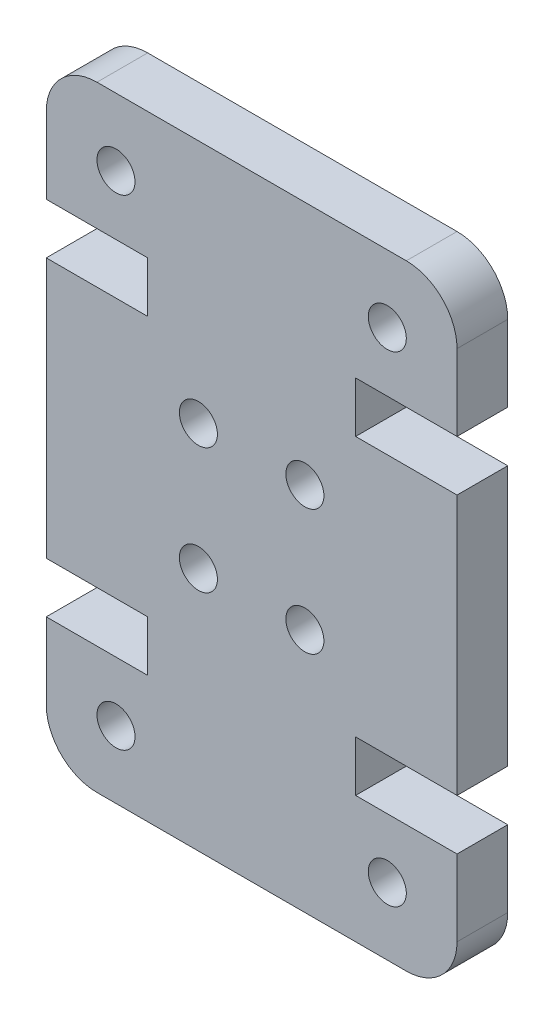
ISO-10303-21;
HEADER;
FILE_DESCRIPTION(('STEP AP214'),'2;1');
FILE_NAME('part.step','',(''),(''),'','','');
FILE_SCHEMA(('AUTOMOTIVE_DESIGN { 1 0 10303 214 1 1 1 1 }'));
ENDSEC;
DATA;
#1=APPLICATION_CONTEXT('core data for automotive mechanical design processes');
#2=APPLICATION_PROTOCOL_DEFINITION('international standard','automotive_design',2000,#1);
#3=PRODUCT_CONTEXT('',#1,'mechanical');
#4=PRODUCT('Part','Part','',(#3));
#5=PRODUCT_RELATED_PRODUCT_CATEGORY('part','',(#4));
#6=PRODUCT_DEFINITION_FORMATION('','',#4);
#7=PRODUCT_DEFINITION_CONTEXT('part definition',#1,'design');
#8=PRODUCT_DEFINITION('design','',#6,#7);
#9=PRODUCT_DEFINITION_SHAPE('','',#8);
#10=(LENGTH_UNIT() NAMED_UNIT(*) SI_UNIT(.MILLI.,.METRE.));
#11=(NAMED_UNIT(*) PLANE_ANGLE_UNIT() SI_UNIT($,.RADIAN.));
#12=(NAMED_UNIT(*) SI_UNIT($,.STERADIAN.) SOLID_ANGLE_UNIT());
#13=UNCERTAINTY_MEASURE_WITH_UNIT(LENGTH_MEASURE(1.E-05),#10,'distance_accuracy_value','');
#14=(GEOMETRIC_REPRESENTATION_CONTEXT(3) GLOBAL_UNCERTAINTY_ASSIGNED_CONTEXT((#13)) GLOBAL_UNIT_ASSIGNED_CONTEXT((#10,
#11,#12)) REPRESENTATION_CONTEXT('',''));
#15=CARTESIAN_POINT('',(0.,0.,0.));
#16=DIRECTION('',(0.,0.,1.));
#17=DIRECTION('',(1.,0.,0.));
#18=AXIS2_PLACEMENT_3D('',#15,#16,#17);
#19=CARTESIAN_POINT('',(14.2,2.,2.));
#20=DIRECTION('',(0.,0.,-1.));
#21=DIRECTION('',(-1.,0.,0.));
#22=AXIS2_PLACEMENT_3D('',#19,#20,#21);
#23=PLANE('',#22);
#24=CARTESIAN_POINT('',(6.00000000000001,9.65355116894447,2.));
#25=DIRECTION('',(0.,0.,1.));
#26=DIRECTION('',(1.,0.,0.));
#27=AXIS2_PLACEMENT_3D('',#24,#25,#26);
#28=CIRCLE('',#27,0.749999999999999);
#29=CARTESIAN_POINT('',(6.75,9.65355116894447,2.));
#30=VERTEX_POINT('',#29);
#31=EDGE_CURVE('E464',#30,#30,#28,.T.);
#32=ORIENTED_EDGE('',*,*,#31,.F.);
#33=EDGE_LOOP('',(#32));
#34=FACE_BOUND('',#33,.T.);
#35=CARTESIAN_POINT('',(10.2,14.6064488310555,2.));
#36=DIRECTION('',(0.,0.,1.));
#37=DIRECTION('',(1.,0.,0.));
#38=AXIS2_PLACEMENT_3D('',#35,#36,#37);
#39=CIRCLE('',#38,0.749999999999998);
#40=CARTESIAN_POINT('',(10.95,14.6064488310555,2.));
#41=VERTEX_POINT('',#40);
#42=EDGE_CURVE('E476',#41,#41,#39,.T.);
#43=ORIENTED_EDGE('',*,*,#42,.F.);
#44=EDGE_LOOP('',(#43));
#45=FACE_BOUND('',#44,.T.);
#46=CARTESIAN_POINT('',(2.75000000000003,21.606448831055,2.));
#47=DIRECTION('',(0.,0.,1.));
#48=DIRECTION('',(-1.,0.,0.));
#49=AXIS2_PLACEMENT_3D('',#46,#47,#48);
#50=CIRCLE('',#49,0.749999999999999);
#51=CARTESIAN_POINT('',(2.00000000000003,21.606448831055,2.));
#52=VERTEX_POINT('',#51);
#53=EDGE_CURVE('E488',#52,#52,#50,.T.);
#54=ORIENTED_EDGE('',*,*,#53,.F.);
#55=EDGE_LOOP('',(#54));
#56=FACE_BOUND('',#55,.T.);
#57=CARTESIAN_POINT('',(13.45,2.65355116894501,2.));
#58=DIRECTION('',(0.,0.,1.));
#59=DIRECTION('',(-1.,0.,0.));
#60=AXIS2_PLACEMENT_3D('',#57,#58,#59);
#61=CIRCLE('',#60,0.75);
#62=CARTESIAN_POINT('',(12.7,2.65355116894501,2.));
#63=VERTEX_POINT('',#62);
#64=EDGE_CURVE('E230',#63,#63,#61,.T.);
#65=ORIENTED_EDGE('',*,*,#64,.F.);
#66=EDGE_LOOP('',(#65));
#67=FACE_BOUND('',#66,.T.);
#68=CARTESIAN_POINT('',(14.2,2.,2.));
#69=DIRECTION('',(0.,0.,1.));
#70=DIRECTION('',(-1.,0.,0.));
#71=AXIS2_PLACEMENT_3D('',#68,#69,#70);
#72=CIRCLE('',#71,2.);
#73=CARTESIAN_POINT('',(14.2,0.,2.));
#74=VERTEX_POINT('',#73);
#75=CARTESIAN_POINT('',(16.2,2.,2.));
#76=VERTEX_POINT('',#75);
#77=EDGE_CURVE('E273',#74,#76,#72,.T.);
#78=ORIENTED_EDGE('',*,*,#77,.T.);
#79=DIRECTION('',(0.,1.,0.));
#80=VECTOR('',#79,1.);
#81=CARTESIAN_POINT('',(16.2,2.,2.));
#82=LINE('',#81,#80);
#83=CARTESIAN_POINT('',(16.2,4.99999999999945,2.));
#84=VERTEX_POINT('',#83);
#85=EDGE_CURVE('E141',#76,#84,#82,.T.);
#86=ORIENTED_EDGE('',*,*,#85,.T.);
#87=DIRECTION('',(-1.,0.,0.));
#88=VECTOR('',#87,1.);
#89=CARTESIAN_POINT('',(12.2,4.99999999999945,2.));
#90=LINE('',#89,#88);
#91=CARTESIAN_POINT('',(12.2,4.99999999999945,2.));
#92=VERTEX_POINT('',#91);
#93=EDGE_CURVE('E336',#84,#92,#90,.T.);
#94=ORIENTED_EDGE('',*,*,#93,.T.);
#95=DIRECTION('',(0.,1.,0.));
#96=VECTOR('',#95,1.);
#97=CARTESIAN_POINT('',(12.2,6.99999999999945,2.));
#98=LINE('',#97,#96);
#99=CARTESIAN_POINT('',(12.2,6.99999999999945,2.));
#100=VERTEX_POINT('',#99);
#101=EDGE_CURVE('E355',#92,#100,#98,.T.);
#102=ORIENTED_EDGE('',*,*,#101,.T.);
#103=DIRECTION('',(1.,0.,0.));
#104=VECTOR('',#103,1.);
#105=CARTESIAN_POINT('',(16.2,6.99999999999945,2.));
#106=LINE('',#105,#104);
#107=CARTESIAN_POINT('',(16.2,6.99999999999945,2.));
#108=VERTEX_POINT('',#107);
#109=EDGE_CURVE('E352',#100,#108,#106,.T.);
#110=ORIENTED_EDGE('',*,*,#109,.T.);
#111=DIRECTION('',(0.,1.,0.));
#112=VECTOR('',#111,1.);
#113=CARTESIAN_POINT('',(16.2,17.2600000000005,2.));
#114=LINE('',#113,#112);
#115=CARTESIAN_POINT('',(16.2,17.2600000000005,2.));
#116=VERTEX_POINT('',#115);
#117=EDGE_CURVE('E354',#108,#116,#114,.T.);
#118=ORIENTED_EDGE('',*,*,#117,.T.);
#119=DIRECTION('',(-1.,0.,0.));
#120=VECTOR('',#119,1.);
#121=CARTESIAN_POINT('',(16.2,17.2600000000005,2.));
#122=LINE('',#121,#120);
#123=CARTESIAN_POINT('',(12.2,17.2600000000005,2.));
#124=VERTEX_POINT('',#123);
#125=EDGE_CURVE('E357',#116,#124,#122,.T.);
#126=ORIENTED_EDGE('',*,*,#125,.T.);
#127=DIRECTION('',(0.,1.,0.));
#128=VECTOR('',#127,1.);
#129=CARTESIAN_POINT('',(12.2,17.2600000000005,2.));
#130=LINE('',#129,#128);
#131=CARTESIAN_POINT('',(12.2,19.2600000000005,2.));
#132=VERTEX_POINT('',#131);
#133=EDGE_CURVE('E363',#124,#132,#130,.T.);
#134=ORIENTED_EDGE('',*,*,#133,.T.);
#135=DIRECTION('',(1.,0.,0.));
#136=VECTOR('',#135,1.);
#137=CARTESIAN_POINT('',(12.2,19.2600000000005,2.));
#138=LINE('',#137,#136);
#139=CARTESIAN_POINT('',(16.2,19.2600000000005,2.));
#140=VERTEX_POINT('',#139);
#141=EDGE_CURVE('E365',#132,#140,#138,.T.);
#142=ORIENTED_EDGE('',*,*,#141,.T.);
#143=DIRECTION('',(0.,1.,0.));
#144=VECTOR('',#143,1.);
#145=CARTESIAN_POINT('',(16.2,22.26,2.));
#146=LINE('',#145,#144);
#147=CARTESIAN_POINT('',(16.2,22.26,2.));
#148=VERTEX_POINT('',#147);
#149=EDGE_CURVE('E367',#140,#148,#146,.T.);
#150=ORIENTED_EDGE('',*,*,#149,.T.);
#151=CARTESIAN_POINT('',(14.2,22.26,2.));
#152=DIRECTION('',(0.,0.,1.));
#153=DIRECTION('',(1.,0.,0.));
#154=AXIS2_PLACEMENT_3D('',#151,#152,#153);
#155=CIRCLE('',#154,2.);
#156=CARTESIAN_POINT('',(14.2,24.26,2.));
#157=VERTEX_POINT('',#156);
#158=EDGE_CURVE('E369',#148,#157,#155,.T.);
#159=ORIENTED_EDGE('',*,*,#158,.T.);
#160=DIRECTION('',(-1.,0.,0.));
#161=VECTOR('',#160,1.);
#162=CARTESIAN_POINT('',(1.99999999999999,24.26,2.));
#163=LINE('',#162,#161);
#164=CARTESIAN_POINT('',(1.99999999999999,24.26,2.));
#165=VERTEX_POINT('',#164);
#166=EDGE_CURVE('E371',#157,#165,#163,.T.);
#167=ORIENTED_EDGE('',*,*,#166,.T.);
#168=CARTESIAN_POINT('',(2.,22.26,2.));
#169=DIRECTION('',(0.,0.,1.));
#170=DIRECTION('',(-1.,0.,0.));
#171=AXIS2_PLACEMENT_3D('',#168,#169,#170);
#172=CIRCLE('',#171,2.);
#173=CARTESIAN_POINT('',(0.,22.26,2.));
#174=VERTEX_POINT('',#173);
#175=EDGE_CURVE('E373',#165,#174,#172,.T.);
#176=ORIENTED_EDGE('',*,*,#175,.T.);
#177=DIRECTION('',(0.,-1.,0.));
#178=VECTOR('',#177,1.);
#179=CARTESIAN_POINT('',(0.,22.26,2.));
#180=LINE('',#179,#178);
#181=CARTESIAN_POINT('',(0.,19.2600000000005,2.));
#182=VERTEX_POINT('',#181);
#183=EDGE_CURVE('E375',#174,#182,#180,.T.);
#184=ORIENTED_EDGE('',*,*,#183,.T.);
#185=DIRECTION('',(1.,0.,0.));
#186=VECTOR('',#185,1.);
#187=CARTESIAN_POINT('',(3.99999999999999,19.2600000000005,2.));
#188=LINE('',#187,#186);
#189=CARTESIAN_POINT('',(3.99999999999999,19.2600000000005,2.));
#190=VERTEX_POINT('',#189);
#191=EDGE_CURVE('E377',#182,#190,#188,.T.);
#192=ORIENTED_EDGE('',*,*,#191,.T.);
#193=DIRECTION('',(0.,-1.,0.));
#194=VECTOR('',#193,1.);
#195=CARTESIAN_POINT('',(3.99999999999999,17.2600000000005,2.));
#196=LINE('',#195,#194);
#197=CARTESIAN_POINT('',(3.99999999999999,17.2600000000005,2.));
#198=VERTEX_POINT('',#197);
#199=EDGE_CURVE('E379',#190,#198,#196,.T.);
#200=ORIENTED_EDGE('',*,*,#199,.T.);
#201=DIRECTION('',(-1.,0.,0.));
#202=VECTOR('',#201,1.);
#203=CARTESIAN_POINT('',(0.,17.2600000000005,2.));
#204=LINE('',#203,#202);
#205=CARTESIAN_POINT('',(0.,17.2600000000005,2.));
#206=VERTEX_POINT('',#205);
#207=EDGE_CURVE('E381',#198,#206,#204,.T.);
#208=ORIENTED_EDGE('',*,*,#207,.T.);
#209=DIRECTION('',(0.,-1.,0.));
#210=VECTOR('',#209,1.);
#211=CARTESIAN_POINT('',(0.,17.2600000000005,2.));
#212=LINE('',#211,#210);
#213=CARTESIAN_POINT('',(0.,6.99999999999945,2.));
#214=VERTEX_POINT('',#213);
#215=EDGE_CURVE('E383',#206,#214,#212,.T.);
#216=ORIENTED_EDGE('',*,*,#215,.T.);
#217=DIRECTION('',(1.,0.,0.));
#218=VECTOR('',#217,1.);
#219=CARTESIAN_POINT('',(0.,6.99999999999945,2.));
#220=LINE('',#219,#218);
#221=CARTESIAN_POINT('',(4.,6.99999999999945,2.));
#222=VERTEX_POINT('',#221);
#223=EDGE_CURVE('E385',#214,#222,#220,.T.);
#224=ORIENTED_EDGE('',*,*,#223,.T.);
#225=DIRECTION('',(0.,-1.,0.));
#226=VECTOR('',#225,1.);
#227=CARTESIAN_POINT('',(4.,6.99999999999945,2.));
#228=LINE('',#227,#226);
#229=CARTESIAN_POINT('',(4.,4.99999999999945,2.));
#230=VERTEX_POINT('',#229);
#231=EDGE_CURVE('E387',#222,#230,#228,.T.);
#232=ORIENTED_EDGE('',*,*,#231,.T.);
#233=DIRECTION('',(-1.,0.,0.));
#234=VECTOR('',#233,1.);
#235=CARTESIAN_POINT('',(4.,4.99999999999945,2.));
#236=LINE('',#235,#234);
#237=CARTESIAN_POINT('',(0.,4.99999999999945,2.));
#238=VERTEX_POINT('',#237);
#239=EDGE_CURVE('E208',#230,#238,#236,.T.);
#240=ORIENTED_EDGE('',*,*,#239,.T.);
#241=DIRECTION('',(0.,-1.,0.));
#242=VECTOR('',#241,1.);
#243=CARTESIAN_POINT('',(0.,2.,2.));
#244=LINE('',#243,#242);
#245=CARTESIAN_POINT('',(0.,2.,2.));
#246=VERTEX_POINT('',#245);
#247=EDGE_CURVE('E202',#238,#246,#244,.T.);
#248=ORIENTED_EDGE('',*,*,#247,.T.);
#249=CARTESIAN_POINT('',(2.,2.,2.));
#250=DIRECTION('',(0.,0.,1.));
#251=DIRECTION('',(1.,0.,0.));
#252=AXIS2_PLACEMENT_3D('',#249,#250,#251);
#253=CIRCLE('',#252,2.);
#254=CARTESIAN_POINT('',(2.,0.,2.));
#255=VERTEX_POINT('',#254);
#256=EDGE_CURVE('E206',#246,#255,#253,.T.);
#257=ORIENTED_EDGE('',*,*,#256,.T.);
#258=DIRECTION('',(1.,0.,0.));
#259=VECTOR('',#258,1.);
#260=CARTESIAN_POINT('',(2.,0.,2.));
#261=LINE('',#260,#259);
#262=EDGE_CURVE('E50',#255,#74,#261,.T.);
#263=ORIENTED_EDGE('',*,*,#262,.T.);
#264=EDGE_LOOP('',(#78,#86,#94,#102,#110,#118,#126,#134,#142,#150,#159,#167,#176,#184,#192,#200,
#208,#216,#224,#232,#240,#248,#257,#263));
#265=FACE_BOUND('',#264,.T.);
#266=CARTESIAN_POINT('',(10.2,9.65355116894447,2.));
#267=DIRECTION('',(0.,0.,1.));
#268=DIRECTION('',(-1.,0.,0.));
#269=AXIS2_PLACEMENT_3D('',#266,#267,#268);
#270=CIRCLE('',#269,0.749999999999998);
#271=CARTESIAN_POINT('',(9.44999999999999,9.65355116894447,2.));
#272=VERTEX_POINT('',#271);
#273=EDGE_CURVE('E494',#272,#272,#270,.T.);
#274=ORIENTED_EDGE('',*,*,#273,.F.);
#275=EDGE_LOOP('',(#274));
#276=FACE_BOUND('',#275,.T.);
#277=CARTESIAN_POINT('',(6.,14.6064488310555,2.));
#278=DIRECTION('',(0.,0.,1.));
#279=DIRECTION('',(-1.,0.,0.));
#280=AXIS2_PLACEMENT_3D('',#277,#278,#279);
#281=CIRCLE('',#280,0.75);
#282=CARTESIAN_POINT('',(5.25,14.6064488310555,2.));
#283=VERTEX_POINT('',#282);
#284=EDGE_CURVE('E482',#283,#283,#281,.T.);
#285=ORIENTED_EDGE('',*,*,#284,.F.);
#286=EDGE_LOOP('',(#285));
#287=FACE_BOUND('',#286,.T.);
#288=CARTESIAN_POINT('',(13.45,21.606448831055,2.));
#289=DIRECTION('',(0.,0.,1.));
#290=DIRECTION('',(1.,0.,0.));
#291=AXIS2_PLACEMENT_3D('',#288,#289,#290);
#292=CIRCLE('',#291,0.75);
#293=CARTESIAN_POINT('',(14.2,21.606448831055,2.));
#294=VERTEX_POINT('',#293);
#295=EDGE_CURVE('E470',#294,#294,#292,.T.);
#296=ORIENTED_EDGE('',*,*,#295,.F.);
#297=EDGE_LOOP('',(#296));
#298=FACE_BOUND('',#297,.T.);
#299=CARTESIAN_POINT('',(2.75000000000003,2.65355116894501,2.));
#300=DIRECTION('',(0.,0.,1.));
#301=DIRECTION('',(1.,0.,0.));
#302=AXIS2_PLACEMENT_3D('',#299,#300,#301);
#303=CIRCLE('',#302,0.749999999999999);
#304=CARTESIAN_POINT('',(3.50000000000003,2.65355116894501,2.));
#305=VERTEX_POINT('',#304);
#306=EDGE_CURVE('E455',#305,#305,#303,.T.);
#307=ORIENTED_EDGE('',*,*,#306,.F.);
#308=EDGE_LOOP('',(#307));
#309=FACE_BOUND('',#308,.T.);
#310=ADVANCED_FACE('F33',(#34,#45,#56,#67,#265,#276,#287,#298,#309),#23,.F.);
#311=CARTESIAN_POINT('',(14.2,2.,0.));
#312=DIRECTION('',(0.,0.,-1.));
#313=DIRECTION('',(-1.,0.,0.));
#314=AXIS2_PLACEMENT_3D('',#311,#312,#313);
#315=PLANE('',#314);
#316=CARTESIAN_POINT('',(6.00000000000001,9.65355116894447,0.));
#317=DIRECTION('',(0.,0.,1.));
#318=DIRECTION('',(1.,0.,0.));
#319=AXIS2_PLACEMENT_3D('',#316,#317,#318);
#320=CIRCLE('',#319,0.749999999999999);
#321=CARTESIAN_POINT('',(6.75,9.65355116894447,0.));
#322=VERTEX_POINT('',#321);
#323=EDGE_CURVE('E461',#322,#322,#320,.T.);
#324=ORIENTED_EDGE('',*,*,#323,.T.);
#325=EDGE_LOOP('',(#324));
#326=FACE_BOUND('',#325,.T.);
#327=CARTESIAN_POINT('',(10.2,14.6064488310555,0.));
#328=DIRECTION('',(0.,0.,1.));
#329=DIRECTION('',(1.,0.,0.));
#330=AXIS2_PLACEMENT_3D('',#327,#328,#329);
#331=CIRCLE('',#330,0.749999999999998);
#332=CARTESIAN_POINT('',(10.95,14.6064488310555,0.));
#333=VERTEX_POINT('',#332);
#334=EDGE_CURVE('E473',#333,#333,#331,.T.);
#335=ORIENTED_EDGE('',*,*,#334,.T.);
#336=EDGE_LOOP('',(#335));
#337=FACE_BOUND('',#336,.T.);
#338=CARTESIAN_POINT('',(2.75000000000003,21.606448831055,0.));
#339=DIRECTION('',(0.,0.,1.));
#340=DIRECTION('',(-1.,0.,0.));
#341=AXIS2_PLACEMENT_3D('',#338,#339,#340);
#342=CIRCLE('',#341,0.749999999999999);
#343=CARTESIAN_POINT('',(2.00000000000003,21.606448831055,0.));
#344=VERTEX_POINT('',#343);
#345=EDGE_CURVE('E485',#344,#344,#342,.T.);
#346=ORIENTED_EDGE('',*,*,#345,.T.);
#347=EDGE_LOOP('',(#346));
#348=FACE_BOUND('',#347,.T.);
#349=CARTESIAN_POINT('',(13.45,2.65355116894501,0.));
#350=DIRECTION('',(0.,0.,1.));
#351=DIRECTION('',(-1.,0.,0.));
#352=AXIS2_PLACEMENT_3D('',#349,#350,#351);
#353=CIRCLE('',#352,0.75);
#354=CARTESIAN_POINT('',(12.7,2.65355116894501,0.));
#355=VERTEX_POINT('',#354);
#356=EDGE_CURVE('E497',#355,#355,#353,.T.);
#357=ORIENTED_EDGE('',*,*,#356,.T.);
#358=EDGE_LOOP('',(#357));
#359=FACE_BOUND('',#358,.T.);
#360=CARTESIAN_POINT('',(14.2,2.,0.));
#361=DIRECTION('',(0.,0.,1.));
#362=DIRECTION('',(-1.,0.,0.));
#363=AXIS2_PLACEMENT_3D('',#360,#361,#362);
#364=CIRCLE('',#363,2.);
#365=CARTESIAN_POINT('',(14.2,0.,0.));
#366=VERTEX_POINT('',#365);
#367=CARTESIAN_POINT('',(16.2,2.,0.));
#368=VERTEX_POINT('',#367);
#369=EDGE_CURVE('E226',#366,#368,#364,.T.);
#370=ORIENTED_EDGE('',*,*,#369,.F.);
#371=DIRECTION('',(1.,0.,0.));
#372=VECTOR('',#371,1.);
#373=CARTESIAN_POINT('',(2.,0.,0.));
#374=LINE('',#373,#372);
#375=CARTESIAN_POINT('',(2.,0.,0.));
#376=VERTEX_POINT('',#375);
#377=EDGE_CURVE('E133',#376,#366,#374,.T.);
#378=ORIENTED_EDGE('',*,*,#377,.F.);
#379=CARTESIAN_POINT('',(2.,2.,0.));
#380=DIRECTION('',(0.,0.,1.));
#381=DIRECTION('',(1.,0.,0.));
#382=AXIS2_PLACEMENT_3D('',#379,#380,#381);
#383=CIRCLE('',#382,2.);
#384=CARTESIAN_POINT('',(0.,2.,0.));
#385=VERTEX_POINT('',#384);
#386=EDGE_CURVE('E127',#385,#376,#383,.T.);
#387=ORIENTED_EDGE('',*,*,#386,.F.);
#388=DIRECTION('',(0.,-1.,0.));
#389=VECTOR('',#388,1.);
#390=CARTESIAN_POINT('',(0.,2.,0.));
#391=LINE('',#390,#389);
#392=CARTESIAN_POINT('',(0.,4.99999999999945,0.));
#393=VERTEX_POINT('',#392);
#394=EDGE_CURVE('E216',#393,#385,#391,.T.);
#395=ORIENTED_EDGE('',*,*,#394,.F.);
#396=DIRECTION('',(-1.,0.,0.));
#397=VECTOR('',#396,1.);
#398=CARTESIAN_POINT('',(4.,4.99999999999945,0.));
#399=LINE('',#398,#397);
#400=CARTESIAN_POINT('',(4.,4.99999999999945,0.));
#401=VERTEX_POINT('',#400);
#402=EDGE_CURVE('E268',#401,#393,#399,.T.);
#403=ORIENTED_EDGE('',*,*,#402,.F.);
#404=DIRECTION('',(0.,-1.,0.));
#405=VECTOR('',#404,1.);
#406=CARTESIAN_POINT('',(4.,6.99999999999945,0.));
#407=LINE('',#406,#405);
#408=CARTESIAN_POINT('',(4.,6.99999999999945,0.));
#409=VERTEX_POINT('',#408);
#410=EDGE_CURVE('E266',#409,#401,#407,.T.);
#411=ORIENTED_EDGE('',*,*,#410,.F.);
#412=DIRECTION('',(1.,0.,0.));
#413=VECTOR('',#412,1.);
#414=CARTESIAN_POINT('',(0.,6.99999999999945,0.));
#415=LINE('',#414,#413);
#416=CARTESIAN_POINT('',(0.,6.99999999999945,0.));
#417=VERTEX_POINT('',#416);
#418=EDGE_CURVE('E264',#417,#409,#415,.T.);
#419=ORIENTED_EDGE('',*,*,#418,.F.);
#420=DIRECTION('',(0.,-1.,0.));
#421=VECTOR('',#420,1.);
#422=CARTESIAN_POINT('',(0.,17.2600000000005,0.));
#423=LINE('',#422,#421);
#424=CARTESIAN_POINT('',(0.,17.2600000000005,0.));
#425=VERTEX_POINT('',#424);
#426=EDGE_CURVE('E262',#425,#417,#423,.T.);
#427=ORIENTED_EDGE('',*,*,#426,.F.);
#428=DIRECTION('',(-1.,0.,0.));
#429=VECTOR('',#428,1.);
#430=CARTESIAN_POINT('',(0.,17.2600000000005,0.));
#431=LINE('',#430,#429);
#432=CARTESIAN_POINT('',(3.99999999999999,17.2600000000005,0.));
#433=VERTEX_POINT('',#432);
#434=EDGE_CURVE('E260',#433,#425,#431,.T.);
#435=ORIENTED_EDGE('',*,*,#434,.F.);
#436=DIRECTION('',(0.,-1.,0.));
#437=VECTOR('',#436,1.);
#438=CARTESIAN_POINT('',(3.99999999999999,17.2600000000005,0.));
#439=LINE('',#438,#437);
#440=CARTESIAN_POINT('',(3.99999999999999,19.2600000000005,0.));
#441=VERTEX_POINT('',#440);
#442=EDGE_CURVE('E258',#441,#433,#439,.T.);
#443=ORIENTED_EDGE('',*,*,#442,.F.);
#444=DIRECTION('',(1.,0.,0.));
#445=VECTOR('',#444,1.);
#446=CARTESIAN_POINT('',(3.99999999999999,19.2600000000005,0.));
#447=LINE('',#446,#445);
#448=CARTESIAN_POINT('',(0.,19.2600000000005,0.));
#449=VERTEX_POINT('',#448);
#450=EDGE_CURVE('E256',#449,#441,#447,.T.);
#451=ORIENTED_EDGE('',*,*,#450,.F.);
#452=DIRECTION('',(0.,-1.,0.));
#453=VECTOR('',#452,1.);
#454=CARTESIAN_POINT('',(0.,22.26,0.));
#455=LINE('',#454,#453);
#456=CARTESIAN_POINT('',(0.,22.26,0.));
#457=VERTEX_POINT('',#456);
#458=EDGE_CURVE('E254',#457,#449,#455,.T.);
#459=ORIENTED_EDGE('',*,*,#458,.F.);
#460=CARTESIAN_POINT('',(2.,22.26,0.));
#461=DIRECTION('',(0.,0.,1.));
#462=DIRECTION('',(-1.,0.,0.));
#463=AXIS2_PLACEMENT_3D('',#460,#461,#462);
#464=CIRCLE('',#463,2.);
#465=CARTESIAN_POINT('',(1.99999999999999,24.26,0.));
#466=VERTEX_POINT('',#465);
#467=EDGE_CURVE('E252',#466,#457,#464,.T.);
#468=ORIENTED_EDGE('',*,*,#467,.F.);
#469=DIRECTION('',(-1.,0.,0.));
#470=VECTOR('',#469,1.);
#471=CARTESIAN_POINT('',(1.99999999999999,24.26,0.));
#472=LINE('',#471,#470);
#473=CARTESIAN_POINT('',(14.2,24.26,0.));
#474=VERTEX_POINT('',#473);
#475=EDGE_CURVE('E250',#474,#466,#472,.T.);
#476=ORIENTED_EDGE('',*,*,#475,.F.);
#477=CARTESIAN_POINT('',(14.2,22.26,0.));
#478=DIRECTION('',(0.,0.,1.));
#479=DIRECTION('',(1.,0.,0.));
#480=AXIS2_PLACEMENT_3D('',#477,#478,#479);
#481=CIRCLE('',#480,2.);
#482=CARTESIAN_POINT('',(16.2,22.26,0.));
#483=VERTEX_POINT('',#482);
#484=EDGE_CURVE('E248',#483,#474,#481,.T.);
#485=ORIENTED_EDGE('',*,*,#484,.F.);
#486=DIRECTION('',(0.,1.,0.));
#487=VECTOR('',#486,1.);
#488=CARTESIAN_POINT('',(16.2,22.26,0.));
#489=LINE('',#488,#487);
#490=CARTESIAN_POINT('',(16.2,19.2600000000005,0.));
#491=VERTEX_POINT('',#490);
#492=EDGE_CURVE('E246',#491,#483,#489,.T.);
#493=ORIENTED_EDGE('',*,*,#492,.F.);
#494=DIRECTION('',(1.,0.,0.));
#495=VECTOR('',#494,1.);
#496=CARTESIAN_POINT('',(12.2,19.2600000000005,0.));
#497=LINE('',#496,#495);
#498=CARTESIAN_POINT('',(12.2,19.2600000000005,0.));
#499=VERTEX_POINT('',#498);
#500=EDGE_CURVE('E244',#499,#491,#497,.T.);
#501=ORIENTED_EDGE('',*,*,#500,.F.);
#502=DIRECTION('',(0.,1.,0.));
#503=VECTOR('',#502,1.);
#504=CARTESIAN_POINT('',(12.2,17.2600000000005,0.));
#505=LINE('',#504,#503);
#506=CARTESIAN_POINT('',(12.2,17.2600000000005,0.));
#507=VERTEX_POINT('',#506);
#508=EDGE_CURVE('E242',#507,#499,#505,.T.);
#509=ORIENTED_EDGE('',*,*,#508,.F.);
#510=DIRECTION('',(-1.,0.,0.));
#511=VECTOR('',#510,1.);
#512=CARTESIAN_POINT('',(16.2,17.2600000000005,0.));
#513=LINE('',#512,#511);
#514=CARTESIAN_POINT('',(16.2,17.2600000000005,0.));
#515=VERTEX_POINT('',#514);
#516=EDGE_CURVE('E240',#515,#507,#513,.T.);
#517=ORIENTED_EDGE('',*,*,#516,.F.);
#518=DIRECTION('',(0.,1.,0.));
#519=VECTOR('',#518,1.);
#520=CARTESIAN_POINT('',(16.2,17.2600000000005,0.));
#521=LINE('',#520,#519);
#522=CARTESIAN_POINT('',(16.2,6.99999999999945,0.));
#523=VERTEX_POINT('',#522);
#524=EDGE_CURVE('E238',#523,#515,#521,.T.);
#525=ORIENTED_EDGE('',*,*,#524,.F.);
#526=DIRECTION('',(1.,0.,0.));
#527=VECTOR('',#526,1.);
#528=CARTESIAN_POINT('',(16.2,6.99999999999945,0.));
#529=LINE('',#528,#527);
#530=CARTESIAN_POINT('',(12.2,6.99999999999945,0.));
#531=VERTEX_POINT('',#530);
#532=EDGE_CURVE('E236',#531,#523,#529,.T.);
#533=ORIENTED_EDGE('',*,*,#532,.F.);
#534=DIRECTION('',(0.,1.,0.));
#535=VECTOR('',#534,1.);
#536=CARTESIAN_POINT('',(12.2,6.99999999999945,0.));
#537=LINE('',#536,#535);
#538=CARTESIAN_POINT('',(12.2,4.99999999999945,0.));
#539=VERTEX_POINT('',#538);
#540=EDGE_CURVE('E234',#539,#531,#537,.T.);
#541=ORIENTED_EDGE('',*,*,#540,.F.);
#542=DIRECTION('',(-1.,0.,0.));
#543=VECTOR('',#542,1.);
#544=CARTESIAN_POINT('',(12.2,4.99999999999945,0.));
#545=LINE('',#544,#543);
#546=CARTESIAN_POINT('',(16.2,4.99999999999945,0.));
#547=VERTEX_POINT('',#546);
#548=EDGE_CURVE('E232',#547,#539,#545,.T.);
#549=ORIENTED_EDGE('',*,*,#548,.F.);
#550=DIRECTION('',(0.,1.,0.));
#551=VECTOR('',#550,1.);
#552=CARTESIAN_POINT('',(16.2,2.,0.));
#553=LINE('',#552,#551);
#554=EDGE_CURVE('E229',#368,#547,#553,.T.);
#555=ORIENTED_EDGE('',*,*,#554,.F.);
#556=EDGE_LOOP('',(#370,#378,#387,#395,#403,#411,#419,#427,#435,#443,#451,#459,#468,#476,#485,
#493,#501,#509,#517,#525,#533,#541,#549,#555));
#557=FACE_BOUND('',#556,.T.);
#558=CARTESIAN_POINT('',(10.2,9.65355116894447,0.));
#559=DIRECTION('',(0.,0.,1.));
#560=DIRECTION('',(-1.,0.,0.));
#561=AXIS2_PLACEMENT_3D('',#558,#559,#560);
#562=CIRCLE('',#561,0.749999999999998);
#563=CARTESIAN_POINT('',(9.44999999999999,9.65355116894447,0.));
#564=VERTEX_POINT('',#563);
#565=EDGE_CURVE('E491',#564,#564,#562,.T.);
#566=ORIENTED_EDGE('',*,*,#565,.T.);
#567=EDGE_LOOP('',(#566));
#568=FACE_BOUND('',#567,.T.);
#569=CARTESIAN_POINT('',(6.,14.6064488310555,0.));
#570=DIRECTION('',(0.,0.,1.));
#571=DIRECTION('',(-1.,0.,0.));
#572=AXIS2_PLACEMENT_3D('',#569,#570,#571);
#573=CIRCLE('',#572,0.75);
#574=CARTESIAN_POINT('',(5.25,14.6064488310555,0.));
#575=VERTEX_POINT('',#574);
#576=EDGE_CURVE('E479',#575,#575,#573,.T.);
#577=ORIENTED_EDGE('',*,*,#576,.T.);
#578=EDGE_LOOP('',(#577));
#579=FACE_BOUND('',#578,.T.);
#580=CARTESIAN_POINT('',(13.45,21.606448831055,0.));
#581=DIRECTION('',(0.,0.,1.));
#582=DIRECTION('',(1.,0.,0.));
#583=AXIS2_PLACEMENT_3D('',#580,#581,#582);
#584=CIRCLE('',#583,0.75);
#585=CARTESIAN_POINT('',(14.2,21.606448831055,0.));
#586=VERTEX_POINT('',#585);
#587=EDGE_CURVE('E467',#586,#586,#584,.T.);
#588=ORIENTED_EDGE('',*,*,#587,.T.);
#589=EDGE_LOOP('',(#588));
#590=FACE_BOUND('',#589,.T.);
#591=CARTESIAN_POINT('',(2.75000000000003,2.65355116894501,0.));
#592=DIRECTION('',(0.,0.,1.));
#593=DIRECTION('',(1.,0.,0.));
#594=AXIS2_PLACEMENT_3D('',#591,#592,#593);
#595=CIRCLE('',#594,0.749999999999999);
#596=CARTESIAN_POINT('',(3.50000000000003,2.65355116894501,0.));
#597=VERTEX_POINT('',#596);
#598=EDGE_CURVE('E458',#597,#597,#595,.T.);
#599=ORIENTED_EDGE('',*,*,#598,.T.);
#600=EDGE_LOOP('',(#599));
#601=FACE_BOUND('',#600,.T.);
#602=ADVANCED_FACE('F340',(#326,#337,#348,#359,#557,#568,#579,#590,#601),#315,.T.);
#603=CARTESIAN_POINT('',(14.2,2.,2.));
#604=DIRECTION('',(0.,0.,-1.));
#605=DIRECTION('',(-1.,0.,0.));
#606=AXIS2_PLACEMENT_3D('',#603,#604,#605);
#607=CYLINDRICAL_SURFACE('',#606,2.);
#608=ORIENTED_EDGE('',*,*,#369,.T.);
#609=DIRECTION('',(0.,0.,-1.));
#610=VECTOR('',#609,1.);
#611=CARTESIAN_POINT('',(16.2,2.,2.));
#612=LINE('',#611,#610);
#613=EDGE_CURVE('E11',#76,#368,#612,.T.);
#614=ORIENTED_EDGE('',*,*,#613,.F.);
#615=ORIENTED_EDGE('',*,*,#77,.F.);
#616=DIRECTION('',(0.,0.,-1.));
#617=VECTOR('',#616,1.);
#618=CARTESIAN_POINT('',(14.2,0.,2.));
#619=LINE('',#618,#617);
#620=EDGE_CURVE('E222',#74,#366,#619,.T.);
#621=ORIENTED_EDGE('',*,*,#620,.T.);
#622=EDGE_LOOP('',(#608,#614,#615,#621));
#623=FACE_BOUND('',#622,.T.);
#624=ADVANCED_FACE('F35',(#623),#607,.T.);
#625=CARTESIAN_POINT('',(16.2,2.,2.));
#626=DIRECTION('',(-1.,0.,0.));
#627=DIRECTION('',(0.,-1.,0.));
#628=AXIS2_PLACEMENT_3D('',#625,#626,#627);
#629=PLANE('',#628);
#630=ORIENTED_EDGE('',*,*,#554,.T.);
#631=DIRECTION('',(0.,0.,-1.));
#632=VECTOR('',#631,1.);
#633=CARTESIAN_POINT('',(16.2,4.99999999999945,2.));
#634=LINE('',#633,#632);
#635=EDGE_CURVE('E42',#84,#547,#634,.T.);
#636=ORIENTED_EDGE('',*,*,#635,.F.);
#637=ORIENTED_EDGE('',*,*,#85,.F.);
#638=ORIENTED_EDGE('',*,*,#613,.T.);
#639=EDGE_LOOP('',(#630,#636,#637,#638));
#640=FACE_BOUND('',#639,.T.);
#641=ADVANCED_FACE('F762',(#640),#629,.F.);
#642=CARTESIAN_POINT('',(12.2,4.99999999999945,2.));
#643=DIRECTION('',(0.,-1.,0.));
#644=DIRECTION('',(0.,0.,-1.));
#645=AXIS2_PLACEMENT_3D('',#642,#643,#644);
#646=PLANE('',#645);
#647=ORIENTED_EDGE('',*,*,#548,.T.);
#648=DIRECTION('',(0.,0.,-1.));
#649=VECTOR('',#648,1.);
#650=CARTESIAN_POINT('',(12.2,4.99999999999945,2.));
#651=LINE('',#650,#649);
#652=EDGE_CURVE('E328',#92,#539,#651,.T.);
#653=ORIENTED_EDGE('',*,*,#652,.F.);
#654=ORIENTED_EDGE('',*,*,#93,.F.);
#655=ORIENTED_EDGE('',*,*,#635,.T.);
#656=EDGE_LOOP('',(#647,#653,#654,#655));
#657=FACE_BOUND('',#656,.T.);
#658=ADVANCED_FACE('F334',(#657),#646,.F.);
#659=CARTESIAN_POINT('',(12.2,6.99999999999945,2.));
#660=DIRECTION('',(-1.,0.,0.));
#661=DIRECTION('',(0.,-1.,0.));
#662=AXIS2_PLACEMENT_3D('',#659,#660,#661);
#663=PLANE('',#662);
#664=ORIENTED_EDGE('',*,*,#540,.T.);
#665=DIRECTION('',(0.,0.,-1.));
#666=VECTOR('',#665,1.);
#667=CARTESIAN_POINT('',(12.2,6.99999999999945,2.));
#668=LINE('',#667,#666);
#669=EDGE_CURVE('E325',#100,#531,#668,.T.);
#670=ORIENTED_EDGE('',*,*,#669,.F.);
#671=ORIENTED_EDGE('',*,*,#101,.F.);
#672=ORIENTED_EDGE('',*,*,#652,.T.);
#673=EDGE_LOOP('',(#664,#670,#671,#672));
#674=FACE_BOUND('',#673,.T.);
#675=ADVANCED_FACE('F346',(#674),#663,.F.);
#676=CARTESIAN_POINT('',(16.2,6.99999999999945,2.));
#677=DIRECTION('',(0.,1.,0.));
#678=DIRECTION('',(-1.,0.,0.));
#679=AXIS2_PLACEMENT_3D('',#676,#677,#678);
#680=PLANE('',#679);
#681=ORIENTED_EDGE('',*,*,#532,.T.);
#682=DIRECTION('',(0.,0.,-1.));
#683=VECTOR('',#682,1.);
#684=CARTESIAN_POINT('',(16.2,6.99999999999945,2.));
#685=LINE('',#684,#683);
#686=EDGE_CURVE('E322',#108,#523,#685,.T.);
#687=ORIENTED_EDGE('',*,*,#686,.F.);
#688=ORIENTED_EDGE('',*,*,#109,.F.);
#689=ORIENTED_EDGE('',*,*,#669,.T.);
#690=EDGE_LOOP('',(#681,#687,#688,#689));
#691=FACE_BOUND('',#690,.T.);
#692=ADVANCED_FACE('F350',(#691),#680,.F.);
#693=CARTESIAN_POINT('',(16.2,17.2600000000005,2.));
#694=DIRECTION('',(-1.,0.,0.));
#695=DIRECTION('',(0.,0.,1.));
#696=AXIS2_PLACEMENT_3D('',#693,#694,#695);
#697=PLANE('',#696);
#698=ORIENTED_EDGE('',*,*,#524,.T.);
#699=DIRECTION('',(0.,0.,-1.));
#700=VECTOR('',#699,1.);
#701=CARTESIAN_POINT('',(16.2,17.2600000000005,2.));
#702=LINE('',#701,#700);
#703=EDGE_CURVE('E319',#116,#515,#702,.T.);
#704=ORIENTED_EDGE('',*,*,#703,.F.);
#705=ORIENTED_EDGE('',*,*,#117,.F.);
#706=ORIENTED_EDGE('',*,*,#686,.T.);
#707=EDGE_LOOP('',(#698,#704,#705,#706));
#708=FACE_BOUND('',#707,.T.);
#709=ADVANCED_FACE('F727',(#708),#697,.F.);
#710=CARTESIAN_POINT('',(16.2,17.2600000000005,2.));
#711=DIRECTION('',(0.,-1.,0.));
#712=DIRECTION('',(0.,0.,-1.));
#713=AXIS2_PLACEMENT_3D('',#710,#711,#712);
#714=PLANE('',#713);
#715=ORIENTED_EDGE('',*,*,#516,.T.);
#716=DIRECTION('',(0.,0.,-1.));
#717=VECTOR('',#716,1.);
#718=CARTESIAN_POINT('',(12.2,17.2600000000005,2.));
#719=LINE('',#718,#717);
#720=EDGE_CURVE('E316',#124,#507,#719,.T.);
#721=ORIENTED_EDGE('',*,*,#720,.F.);
#722=ORIENTED_EDGE('',*,*,#125,.F.);
#723=ORIENTED_EDGE('',*,*,#703,.T.);
#724=EDGE_LOOP('',(#715,#721,#722,#723));
#725=FACE_BOUND('',#724,.T.);
#726=ADVANCED_FACE('F717',(#725),#714,.F.);
#727=CARTESIAN_POINT('',(12.2,17.2600000000005,2.));
#728=DIRECTION('',(-1.,0.,0.));
#729=DIRECTION('',(0.,-1.,0.));
#730=AXIS2_PLACEMENT_3D('',#727,#728,#729);
#731=PLANE('',#730);
#732=ORIENTED_EDGE('',*,*,#508,.T.);
#733=DIRECTION('',(0.,0.,-1.));
#734=VECTOR('',#733,1.);
#735=CARTESIAN_POINT('',(12.2,19.2600000000005,2.));
#736=LINE('',#735,#734);
#737=EDGE_CURVE('E313',#132,#499,#736,.T.);
#738=ORIENTED_EDGE('',*,*,#737,.F.);
#739=ORIENTED_EDGE('',*,*,#133,.F.);
#740=ORIENTED_EDGE('',*,*,#720,.T.);
#741=EDGE_LOOP('',(#732,#738,#739,#740));
#742=FACE_BOUND('',#741,.T.);
#743=ADVANCED_FACE('F707',(#742),#731,.F.);
#744=CARTESIAN_POINT('',(12.2,19.2600000000005,2.));
#745=DIRECTION('',(0.,1.,0.));
#746=DIRECTION('',(0.,0.,1.));
#747=AXIS2_PLACEMENT_3D('',#744,#745,#746);
#748=PLANE('',#747);
#749=ORIENTED_EDGE('',*,*,#500,.T.);
#750=DIRECTION('',(0.,0.,-1.));
#751=VECTOR('',#750,1.);
#752=CARTESIAN_POINT('',(16.2,19.2600000000005,2.));
#753=LINE('',#752,#751);
#754=EDGE_CURVE('E310',#140,#491,#753,.T.);
#755=ORIENTED_EDGE('',*,*,#754,.F.);
#756=ORIENTED_EDGE('',*,*,#141,.F.);
#757=ORIENTED_EDGE('',*,*,#737,.T.);
#758=EDGE_LOOP('',(#749,#755,#756,#757));
#759=FACE_BOUND('',#758,.T.);
#760=ADVANCED_FACE('F697',(#759),#748,.F.);
#761=CARTESIAN_POINT('',(16.2,22.26,2.));
#762=DIRECTION('',(-1.,0.,0.));
#763=DIRECTION('',(0.,-1.,0.));
#764=AXIS2_PLACEMENT_3D('',#761,#762,#763);
#765=PLANE('',#764);
#766=ORIENTED_EDGE('',*,*,#492,.T.);
#767=DIRECTION('',(0.,0.,-1.));
#768=VECTOR('',#767,1.);
#769=CARTESIAN_POINT('',(16.2,22.26,2.));
#770=LINE('',#769,#768);
#771=EDGE_CURVE('E307',#148,#483,#770,.T.);
#772=ORIENTED_EDGE('',*,*,#771,.F.);
#773=ORIENTED_EDGE('',*,*,#149,.F.);
#774=ORIENTED_EDGE('',*,*,#754,.T.);
#775=EDGE_LOOP('',(#766,#772,#773,#774));
#776=FACE_BOUND('',#775,.T.);
#777=ADVANCED_FACE('F687',(#776),#765,.F.);
#778=CARTESIAN_POINT('',(14.2,22.26,2.));
#779=DIRECTION('',(0.,0.,-1.));
#780=DIRECTION('',(-1.,0.,0.));
#781=AXIS2_PLACEMENT_3D('',#778,#779,#780);
#782=CYLINDRICAL_SURFACE('',#781,2.);
#783=ORIENTED_EDGE('',*,*,#484,.T.);
#784=DIRECTION('',(0.,0.,-1.));
#785=VECTOR('',#784,1.);
#786=CARTESIAN_POINT('',(14.2,24.26,2.));
#787=LINE('',#786,#785);
#788=EDGE_CURVE('E304',#157,#474,#787,.T.);
#789=ORIENTED_EDGE('',*,*,#788,.F.);
#790=ORIENTED_EDGE('',*,*,#158,.F.);
#791=ORIENTED_EDGE('',*,*,#771,.T.);
#792=EDGE_LOOP('',(#783,#789,#790,#791));
#793=FACE_BOUND('',#792,.T.);
#794=ADVANCED_FACE('F677',(#793),#782,.T.);
#795=CARTESIAN_POINT('',(1.99999999999999,24.26,2.));
#796=DIRECTION('',(0.,-1.,0.));
#797=DIRECTION('',(0.,0.,-1.));
#798=AXIS2_PLACEMENT_3D('',#795,#796,#797);
#799=PLANE('',#798);
#800=ORIENTED_EDGE('',*,*,#475,.T.);
#801=DIRECTION('',(0.,0.,-1.));
#802=VECTOR('',#801,1.);
#803=CARTESIAN_POINT('',(1.99999999999999,24.26,2.));
#804=LINE('',#803,#802);
#805=EDGE_CURVE('E301',#165,#466,#804,.T.);
#806=ORIENTED_EDGE('',*,*,#805,.F.);
#807=ORIENTED_EDGE('',*,*,#166,.F.);
#808=ORIENTED_EDGE('',*,*,#788,.T.);
#809=EDGE_LOOP('',(#800,#806,#807,#808));
#810=FACE_BOUND('',#809,.T.);
#811=ADVANCED_FACE('F667',(#810),#799,.F.);
#812=CARTESIAN_POINT('',(2.,22.26,2.));
#813=DIRECTION('',(0.,0.,-1.));
#814=DIRECTION('',(-1.,0.,0.));
#815=AXIS2_PLACEMENT_3D('',#812,#813,#814);
#816=CYLINDRICAL_SURFACE('',#815,2.);
#817=ORIENTED_EDGE('',*,*,#467,.T.);
#818=DIRECTION('',(0.,0.,-1.));
#819=VECTOR('',#818,1.);
#820=CARTESIAN_POINT('',(0.,22.26,2.));
#821=LINE('',#820,#819);
#822=EDGE_CURVE('E298',#174,#457,#821,.T.);
#823=ORIENTED_EDGE('',*,*,#822,.F.);
#824=ORIENTED_EDGE('',*,*,#175,.F.);
#825=ORIENTED_EDGE('',*,*,#805,.T.);
#826=EDGE_LOOP('',(#817,#823,#824,#825));
#827=FACE_BOUND('',#826,.T.);
#828=ADVANCED_FACE('F657',(#827),#816,.T.);
#829=CARTESIAN_POINT('',(0.,22.26,2.));
#830=DIRECTION('',(1.,0.,0.));
#831=DIRECTION('',(0.,1.,0.));
#832=AXIS2_PLACEMENT_3D('',#829,#830,#831);
#833=PLANE('',#832);
#834=ORIENTED_EDGE('',*,*,#458,.T.);
#835=DIRECTION('',(0.,0.,-1.));
#836=VECTOR('',#835,1.);
#837=CARTESIAN_POINT('',(0.,19.2600000000005,2.));
#838=LINE('',#837,#836);
#839=EDGE_CURVE('E295',#182,#449,#838,.T.);
#840=ORIENTED_EDGE('',*,*,#839,.F.);
#841=ORIENTED_EDGE('',*,*,#183,.F.);
#842=ORIENTED_EDGE('',*,*,#822,.T.);
#843=EDGE_LOOP('',(#834,#840,#841,#842));
#844=FACE_BOUND('',#843,.T.);
#845=ADVANCED_FACE('F647',(#844),#833,.F.);
#846=CARTESIAN_POINT('',(3.99999999999999,19.2600000000005,2.));
#847=DIRECTION('',(0.,1.,0.));
#848=DIRECTION('',(-1.,0.,0.));
#849=AXIS2_PLACEMENT_3D('',#846,#847,#848);
#850=PLANE('',#849);
#851=ORIENTED_EDGE('',*,*,#450,.T.);
#852=DIRECTION('',(0.,0.,-1.));
#853=VECTOR('',#852,1.);
#854=CARTESIAN_POINT('',(3.99999999999999,19.2600000000005,2.));
#855=LINE('',#854,#853);
#856=EDGE_CURVE('E292',#190,#441,#855,.T.);
#857=ORIENTED_EDGE('',*,*,#856,.F.);
#858=ORIENTED_EDGE('',*,*,#191,.F.);
#859=ORIENTED_EDGE('',*,*,#839,.T.);
#860=EDGE_LOOP('',(#851,#857,#858,#859));
#861=FACE_BOUND('',#860,.T.);
#862=ADVANCED_FACE('F637',(#861),#850,.F.);
#863=CARTESIAN_POINT('',(3.99999999999999,17.2600000000005,2.));
#864=DIRECTION('',(1.,0.,0.));
#865=DIRECTION('',(0.,0.,-1.));
#866=AXIS2_PLACEMENT_3D('',#863,#864,#865);
#867=PLANE('',#866);
#868=ORIENTED_EDGE('',*,*,#442,.T.);
#869=DIRECTION('',(0.,0.,-1.));
#870=VECTOR('',#869,1.);
#871=CARTESIAN_POINT('',(3.99999999999999,17.2600000000005,2.));
#872=LINE('',#871,#870);
#873=EDGE_CURVE('E289',#198,#433,#872,.T.);
#874=ORIENTED_EDGE('',*,*,#873,.F.);
#875=ORIENTED_EDGE('',*,*,#199,.F.);
#876=ORIENTED_EDGE('',*,*,#856,.T.);
#877=EDGE_LOOP('',(#868,#874,#875,#876));
#878=FACE_BOUND('',#877,.T.);
#879=ADVANCED_FACE('F627',(#878),#867,.F.);
#880=CARTESIAN_POINT('',(0.,17.2600000000005,2.));
#881=DIRECTION('',(0.,-1.,0.));
#882=DIRECTION('',(1.,0.,0.));
#883=AXIS2_PLACEMENT_3D('',#880,#881,#882);
#884=PLANE('',#883);
#885=ORIENTED_EDGE('',*,*,#434,.T.);
#886=DIRECTION('',(0.,0.,-1.));
#887=VECTOR('',#886,1.);
#888=CARTESIAN_POINT('',(0.,17.2600000000005,2.));
#889=LINE('',#888,#887);
#890=EDGE_CURVE('E286',#206,#425,#889,.T.);
#891=ORIENTED_EDGE('',*,*,#890,.F.);
#892=ORIENTED_EDGE('',*,*,#207,.F.);
#893=ORIENTED_EDGE('',*,*,#873,.T.);
#894=EDGE_LOOP('',(#885,#891,#892,#893));
#895=FACE_BOUND('',#894,.T.);
#896=ADVANCED_FACE('F617',(#895),#884,.F.);
#897=CARTESIAN_POINT('',(0.,17.2600000000005,2.));
#898=DIRECTION('',(1.,0.,0.));
#899=DIRECTION('',(0.,1.,0.));
#900=AXIS2_PLACEMENT_3D('',#897,#898,#899);
#901=PLANE('',#900);
#902=ORIENTED_EDGE('',*,*,#426,.T.);
#903=DIRECTION('',(0.,0.,-1.));
#904=VECTOR('',#903,1.);
#905=CARTESIAN_POINT('',(0.,6.99999999999945,2.));
#906=LINE('',#905,#904);
#907=EDGE_CURVE('E283',#214,#417,#906,.T.);
#908=ORIENTED_EDGE('',*,*,#907,.F.);
#909=ORIENTED_EDGE('',*,*,#215,.F.);
#910=ORIENTED_EDGE('',*,*,#890,.T.);
#911=EDGE_LOOP('',(#902,#908,#909,#910));
#912=FACE_BOUND('',#911,.T.);
#913=ADVANCED_FACE('F607',(#912),#901,.F.);
#914=CARTESIAN_POINT('',(0.,6.99999999999945,2.));
#915=DIRECTION('',(0.,1.,0.));
#916=DIRECTION('',(0.,0.,1.));
#917=AXIS2_PLACEMENT_3D('',#914,#915,#916);
#918=PLANE('',#917);
#919=ORIENTED_EDGE('',*,*,#418,.T.);
#920=DIRECTION('',(0.,0.,-1.));
#921=VECTOR('',#920,1.);
#922=CARTESIAN_POINT('',(4.,6.99999999999945,2.));
#923=LINE('',#922,#921);
#924=EDGE_CURVE('E280',#222,#409,#923,.T.);
#925=ORIENTED_EDGE('',*,*,#924,.F.);
#926=ORIENTED_EDGE('',*,*,#223,.F.);
#927=ORIENTED_EDGE('',*,*,#907,.T.);
#928=EDGE_LOOP('',(#919,#925,#926,#927));
#929=FACE_BOUND('',#928,.T.);
#930=ADVANCED_FACE('F598',(#929),#918,.F.);
#931=CARTESIAN_POINT('',(4.,6.99999999999945,2.));
#932=DIRECTION('',(1.,0.,0.));
#933=DIRECTION('',(0.,0.,-1.));
#934=AXIS2_PLACEMENT_3D('',#931,#932,#933);
#935=PLANE('',#934);
#936=ORIENTED_EDGE('',*,*,#410,.T.);
#937=DIRECTION('',(0.,0.,-1.));
#938=VECTOR('',#937,1.);
#939=CARTESIAN_POINT('',(4.,4.99999999999945,2.));
#940=LINE('',#939,#938);
#941=EDGE_CURVE('E277',#230,#401,#940,.T.);
#942=ORIENTED_EDGE('',*,*,#941,.F.);
#943=ORIENTED_EDGE('',*,*,#231,.F.);
#944=ORIENTED_EDGE('',*,*,#924,.T.);
#945=EDGE_LOOP('',(#936,#942,#943,#944));
#946=FACE_BOUND('',#945,.T.);
#947=ADVANCED_FACE('F393',(#946),#935,.F.);
#948=CARTESIAN_POINT('',(4.,4.99999999999945,2.));
#949=DIRECTION('',(0.,-1.,0.));
#950=DIRECTION('',(0.,0.,-1.));
#951=AXIS2_PLACEMENT_3D('',#948,#949,#950);
#952=PLANE('',#951);
#953=ORIENTED_EDGE('',*,*,#402,.T.);
#954=DIRECTION('',(0.,0.,-1.));
#955=VECTOR('',#954,1.);
#956=CARTESIAN_POINT('',(0.,4.99999999999945,2.));
#957=LINE('',#956,#955);
#958=EDGE_CURVE('E217',#238,#393,#957,.T.);
#959=ORIENTED_EDGE('',*,*,#958,.F.);
#960=ORIENTED_EDGE('',*,*,#239,.F.);
#961=ORIENTED_EDGE('',*,*,#941,.T.);
#962=EDGE_LOOP('',(#953,#959,#960,#961));
#963=FACE_BOUND('',#962,.T.);
#964=ADVANCED_FACE('F397',(#963),#952,.F.);
#965=CARTESIAN_POINT('',(0.,2.,2.));
#966=DIRECTION('',(1.,0.,0.));
#967=DIRECTION('',(0.,0.,-1.));
#968=AXIS2_PLACEMENT_3D('',#965,#966,#967);
#969=PLANE('',#968);
#970=ORIENTED_EDGE('',*,*,#394,.T.);
#971=DIRECTION('',(0.,0.,-1.));
#972=VECTOR('',#971,1.);
#973=CARTESIAN_POINT('',(0.,2.,2.));
#974=LINE('',#973,#972);
#975=EDGE_CURVE('E213',#246,#385,#974,.T.);
#976=ORIENTED_EDGE('',*,*,#975,.F.);
#977=ORIENTED_EDGE('',*,*,#247,.F.);
#978=ORIENTED_EDGE('',*,*,#958,.T.);
#979=EDGE_LOOP('',(#970,#976,#977,#978));
#980=FACE_BOUND('',#979,.T.);
#981=ADVANCED_FACE('F214',(#980),#969,.F.);
#982=CARTESIAN_POINT('',(2.,2.,2.));
#983=DIRECTION('',(0.,0.,-1.));
#984=DIRECTION('',(-1.,0.,0.));
#985=AXIS2_PLACEMENT_3D('',#982,#983,#984);
#986=CYLINDRICAL_SURFACE('',#985,2.);
#987=ORIENTED_EDGE('',*,*,#386,.T.);
#988=DIRECTION('',(0.,0.,-1.));
#989=VECTOR('',#988,1.);
#990=CARTESIAN_POINT('',(2.,0.,2.));
#991=LINE('',#990,#989);
#992=EDGE_CURVE('E218',#255,#376,#991,.T.);
#993=ORIENTED_EDGE('',*,*,#992,.F.);
#994=ORIENTED_EDGE('',*,*,#256,.F.);
#995=ORIENTED_EDGE('',*,*,#975,.T.);
#996=EDGE_LOOP('',(#987,#993,#994,#995));
#997=FACE_BOUND('',#996,.T.);
#998=ADVANCED_FACE('F220',(#997),#986,.T.);
#999=CARTESIAN_POINT('',(2.,0.,2.));
#1000=DIRECTION('',(0.,1.,0.));
#1001=DIRECTION('',(-1.,0.,0.));
#1002=AXIS2_PLACEMENT_3D('',#999,#1000,#1001);
#1003=PLANE('',#1002);
#1004=ORIENTED_EDGE('',*,*,#377,.T.);
#1005=ORIENTED_EDGE('',*,*,#620,.F.);
#1006=ORIENTED_EDGE('',*,*,#262,.F.);
#1007=ORIENTED_EDGE('',*,*,#992,.T.);
#1008=EDGE_LOOP('',(#1004,#1005,#1006,#1007));
#1009=FACE_BOUND('',#1008,.T.);
#1010=ADVANCED_FACE('F401',(#1009),#1003,.F.);
#1011=CARTESIAN_POINT('',(13.45,2.65355116894501,2.));
#1012=DIRECTION('',(0.,0.,-1.));
#1013=DIRECTION('',(-1.,0.,0.));
#1014=AXIS2_PLACEMENT_3D('',#1011,#1012,#1013);
#1015=CYLINDRICAL_SURFACE('',#1014,0.75);
#1016=ORIENTED_EDGE('',*,*,#64,.T.);
#1017=EDGE_LOOP('',(#1016));
#1018=FACE_BOUND('',#1017,.T.);
#1019=ORIENTED_EDGE('',*,*,#356,.F.);
#1020=EDGE_LOOP('',(#1019));
#1021=FACE_BOUND('',#1020,.T.);
#1022=ADVANCED_FACE('F403',(#1018,#1021),#1015,.F.);
#1023=CARTESIAN_POINT('',(10.2,9.65355116894447,2.));
#1024=DIRECTION('',(0.,0.,-1.));
#1025=DIRECTION('',(-1.,0.,0.));
#1026=AXIS2_PLACEMENT_3D('',#1023,#1024,#1025);
#1027=CYLINDRICAL_SURFACE('',#1026,0.749999999999998);
#1028=ORIENTED_EDGE('',*,*,#273,.T.);
#1029=EDGE_LOOP('',(#1028));
#1030=FACE_BOUND('',#1029,.T.);
#1031=ORIENTED_EDGE('',*,*,#565,.F.);
#1032=EDGE_LOOP('',(#1031));
#1033=FACE_BOUND('',#1032,.T.);
#1034=ADVANCED_FACE('F409',(#1030,#1033),#1027,.F.);
#1035=CARTESIAN_POINT('',(2.75000000000003,21.606448831055,2.));
#1036=DIRECTION('',(0.,0.,-1.));
#1037=DIRECTION('',(-1.,0.,0.));
#1038=AXIS2_PLACEMENT_3D('',#1035,#1036,#1037);
#1039=CYLINDRICAL_SURFACE('',#1038,0.749999999999999);
#1040=ORIENTED_EDGE('',*,*,#53,.T.);
#1041=EDGE_LOOP('',(#1040));
#1042=FACE_BOUND('',#1041,.T.);
#1043=ORIENTED_EDGE('',*,*,#345,.F.);
#1044=EDGE_LOOP('',(#1043));
#1045=FACE_BOUND('',#1044,.T.);
#1046=ADVANCED_FACE('F426',(#1042,#1045),#1039,.F.);
#1047=CARTESIAN_POINT('',(6.,14.6064488310555,2.));
#1048=DIRECTION('',(0.,0.,-1.));
#1049=DIRECTION('',(-1.,0.,0.));
#1050=AXIS2_PLACEMENT_3D('',#1047,#1048,#1049);
#1051=CYLINDRICAL_SURFACE('',#1050,0.75);
#1052=ORIENTED_EDGE('',*,*,#284,.T.);
#1053=EDGE_LOOP('',(#1052));
#1054=FACE_BOUND('',#1053,.T.);
#1055=ORIENTED_EDGE('',*,*,#576,.F.);
#1056=EDGE_LOOP('',(#1055));
#1057=FACE_BOUND('',#1056,.T.);
#1058=ADVANCED_FACE('F430',(#1054,#1057),#1051,.F.);
#1059=CARTESIAN_POINT('',(10.2,14.6064488310555,2.));
#1060=DIRECTION('',(0.,0.,-1.));
#1061=DIRECTION('',(-1.,0.,0.));
#1062=AXIS2_PLACEMENT_3D('',#1059,#1060,#1061);
#1063=CYLINDRICAL_SURFACE('',#1062,0.749999999999998);
#1064=ORIENTED_EDGE('',*,*,#42,.T.);
#1065=EDGE_LOOP('',(#1064));
#1066=FACE_BOUND('',#1065,.T.);
#1067=ORIENTED_EDGE('',*,*,#334,.F.);
#1068=EDGE_LOOP('',(#1067));
#1069=FACE_BOUND('',#1068,.T.);
#1070=ADVANCED_FACE('F434',(#1066,#1069),#1063,.F.);
#1071=CARTESIAN_POINT('',(13.45,21.606448831055,2.));
#1072=DIRECTION('',(0.,0.,-1.));
#1073=DIRECTION('',(-1.,0.,0.));
#1074=AXIS2_PLACEMENT_3D('',#1071,#1072,#1073);
#1075=CYLINDRICAL_SURFACE('',#1074,0.75);
#1076=ORIENTED_EDGE('',*,*,#295,.T.);
#1077=EDGE_LOOP('',(#1076));
#1078=FACE_BOUND('',#1077,.T.);
#1079=ORIENTED_EDGE('',*,*,#587,.F.);
#1080=EDGE_LOOP('',(#1079));
#1081=FACE_BOUND('',#1080,.T.);
#1082=ADVANCED_FACE('F438',(#1078,#1081),#1075,.F.);
#1083=CARTESIAN_POINT('',(6.00000000000001,9.65355116894447,2.));
#1084=DIRECTION('',(0.,0.,-1.));
#1085=DIRECTION('',(-1.,0.,0.));
#1086=AXIS2_PLACEMENT_3D('',#1083,#1084,#1085);
#1087=CYLINDRICAL_SURFACE('',#1086,0.749999999999999);
#1088=ORIENTED_EDGE('',*,*,#31,.T.);
#1089=EDGE_LOOP('',(#1088));
#1090=FACE_BOUND('',#1089,.T.);
#1091=ORIENTED_EDGE('',*,*,#323,.F.);
#1092=EDGE_LOOP('',(#1091));
#1093=FACE_BOUND('',#1092,.T.);
#1094=ADVANCED_FACE('F442',(#1090,#1093),#1087,.F.);
#1095=CARTESIAN_POINT('',(2.75000000000003,2.65355116894501,2.));
#1096=DIRECTION('',(0.,0.,-1.));
#1097=DIRECTION('',(-1.,0.,0.));
#1098=AXIS2_PLACEMENT_3D('',#1095,#1096,#1097);
#1099=CYLINDRICAL_SURFACE('',#1098,0.749999999999999);
#1100=ORIENTED_EDGE('',*,*,#306,.T.);
#1101=EDGE_LOOP('',(#1100));
#1102=FACE_BOUND('',#1101,.T.);
#1103=ORIENTED_EDGE('',*,*,#598,.F.);
#1104=EDGE_LOOP('',(#1103));
#1105=FACE_BOUND('',#1104,.T.);
#1106=ADVANCED_FACE('F446',(#1102,#1105),#1099,.F.);
#1107=CLOSED_SHELL('',(#310,#602,#624,#641,#658,#675,#692,#709,#726,#743,#760,#777,#794,#811,
#828,#845,#862,#879,#896,#913,#930,#947,#964,#981,#998,#1010,#1022,#1034,#1046,#1058,#1070,
#1082,#1094,#1106));
#1108=MANIFOLD_SOLID_BREP('B2',#1107);
#1109=ADVANCED_BREP_SHAPE_REPRESENTATION('',(#18,#1108),#14);
#1110=SHAPE_DEFINITION_REPRESENTATION(#9,#1109);
ENDSEC;
END-ISO-10303-21;
